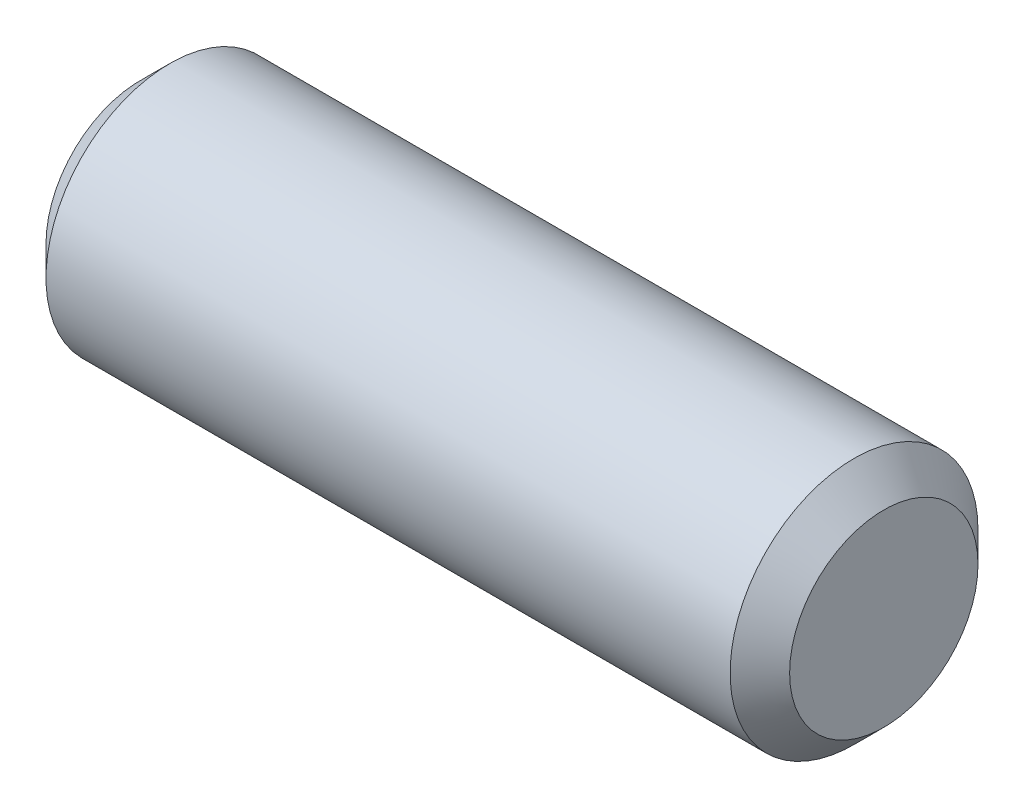
ISO-10303-21;
HEADER;
FILE_DESCRIPTION(('STEP AP214'),'2;1');
FILE_NAME('part.step','',(''),(''),'','','');
FILE_SCHEMA(('AUTOMOTIVE_DESIGN { 1 0 10303 214 1 1 1 1 }'));
ENDSEC;
DATA;
#1=APPLICATION_CONTEXT('core data for automotive mechanical design processes');
#2=APPLICATION_PROTOCOL_DEFINITION('international standard','automotive_design',2000,#1);
#3=PRODUCT_CONTEXT('',#1,'mechanical');
#4=PRODUCT('Part','Part','',(#3));
#5=PRODUCT_RELATED_PRODUCT_CATEGORY('part','',(#4));
#6=PRODUCT_DEFINITION_FORMATION('','',#4);
#7=PRODUCT_DEFINITION_CONTEXT('part definition',#1,'design');
#8=PRODUCT_DEFINITION('design','',#6,#7);
#9=PRODUCT_DEFINITION_SHAPE('','',#8);
#10=(LENGTH_UNIT() NAMED_UNIT(*) SI_UNIT(.MILLI.,.METRE.));
#11=(NAMED_UNIT(*) PLANE_ANGLE_UNIT() SI_UNIT($,.RADIAN.));
#12=(NAMED_UNIT(*) SI_UNIT($,.STERADIAN.) SOLID_ANGLE_UNIT());
#13=UNCERTAINTY_MEASURE_WITH_UNIT(LENGTH_MEASURE(1.E-05),#10,'distance_accuracy_value','');
#14=(GEOMETRIC_REPRESENTATION_CONTEXT(3) GLOBAL_UNCERTAINTY_ASSIGNED_CONTEXT((#13)) GLOBAL_UNIT_ASSIGNED_CONTEXT((#10,
#11,#12)) REPRESENTATION_CONTEXT('',''));
#15=CARTESIAN_POINT('',(0.,0.,0.));
#16=DIRECTION('',(0.,0.,1.));
#17=DIRECTION('',(1.,0.,0.));
#18=AXIS2_PLACEMENT_3D('',#15,#16,#17);
#19=CARTESIAN_POINT('',(38.1,0.,0.));
#20=DIRECTION('',(-1.,0.,0.));
#21=DIRECTION('',(0.,0.,1.));
#22=AXIS2_PLACEMENT_3D('',#19,#20,#21);
#23=CYLINDRICAL_SURFACE('',#22,6.35);
#24=CARTESIAN_POINT('',(1.52400000000003,0.,0.));
#25=DIRECTION('',(1.,0.,0.));
#26=DIRECTION('',(0.,0.,-1.));
#27=AXIS2_PLACEMENT_3D('',#24,#25,#26);
#28=CIRCLE('',#27,6.35);
#29=CARTESIAN_POINT('',(1.52400000000003,0.,-6.35));
#30=VERTEX_POINT('',#29);
#31=EDGE_CURVE('E39',#30,#30,#28,.T.);
#32=ORIENTED_EDGE('',*,*,#31,.T.);
#33=EDGE_LOOP('',(#32));
#34=FACE_BOUND('',#33,.T.);
#35=CARTESIAN_POINT('',(36.576,0.,0.));
#36=DIRECTION('',(1.,0.,0.));
#37=DIRECTION('',(0.,0.,-1.));
#38=AXIS2_PLACEMENT_3D('',#35,#36,#37);
#39=CIRCLE('',#38,6.35);
#40=CARTESIAN_POINT('',(36.576,0.,-6.35));
#41=VERTEX_POINT('',#40);
#42=EDGE_CURVE('E43',#41,#41,#39,.F.);
#43=ORIENTED_EDGE('',*,*,#42,.T.);
#44=EDGE_LOOP('',(#43));
#45=FACE_BOUND('',#44,.T.);
#46=ADVANCED_FACE('F32',(#34,#45),#23,.T.);
#47=CARTESIAN_POINT('',(38.1,0.,0.));
#48=DIRECTION('',(1.,0.,0.));
#49=DIRECTION('',(0.,0.,-1.));
#50=AXIS2_PLACEMENT_3D('',#47,#48,#49);
#51=PLANE('',#50);
#52=CARTESIAN_POINT('',(38.1,0.,0.));
#53=DIRECTION('',(1.,0.,0.));
#54=DIRECTION('',(0.,0.,-1.));
#55=AXIS2_PLACEMENT_3D('',#52,#53,#54);
#56=CIRCLE('',#55,4.82600000000004);
#57=CARTESIAN_POINT('',(38.1,0.,-4.82600000000004));
#58=VERTEX_POINT('',#57);
#59=EDGE_CURVE('E47',#58,#58,#56,.T.);
#60=ORIENTED_EDGE('',*,*,#59,.T.);
#61=EDGE_LOOP('',(#60));
#62=FACE_BOUND('',#61,.T.);
#63=ADVANCED_FACE('F53',(#62),#51,.T.);
#64=CARTESIAN_POINT('',(0.,0.,0.));
#65=DIRECTION('',(1.,0.,0.));
#66=DIRECTION('',(0.,0.,-1.));
#67=AXIS2_PLACEMENT_3D('',#64,#65,#66);
#68=PLANE('',#67);
#69=CARTESIAN_POINT('',(0.,0.,0.));
#70=DIRECTION('',(1.,0.,0.));
#71=DIRECTION('',(0.,0.,-1.));
#72=AXIS2_PLACEMENT_3D('',#69,#70,#71);
#73=CIRCLE('',#72,4.82599999999997);
#74=CARTESIAN_POINT('',(0.,0.,-4.82599999999997));
#75=VERTEX_POINT('',#74);
#76=EDGE_CURVE('E10',#75,#75,#73,.F.);
#77=ORIENTED_EDGE('',*,*,#76,.T.);
#78=EDGE_LOOP('',(#77));
#79=FACE_BOUND('',#78,.T.);
#80=ADVANCED_FACE('F57',(#79),#68,.F.);
#81=CARTESIAN_POINT('',(38.1,0.,0.));
#82=DIRECTION('',(-1.,0.,0.));
#83=DIRECTION('',(0.,0.,1.));
#84=AXIS2_PLACEMENT_3D('',#81,#82,#83);
#85=CONICAL_SURFACE('',#84,4.82600000000004,0.785398163397446);
#86=ORIENTED_EDGE('',*,*,#42,.F.);
#87=EDGE_LOOP('',(#86));
#88=FACE_BOUND('',#87,.T.);
#89=ORIENTED_EDGE('',*,*,#59,.F.);
#90=EDGE_LOOP('',(#89));
#91=FACE_BOUND('',#90,.T.);
#92=ADVANCED_FACE('F55',(#88,#91),#85,.T.);
#93=CARTESIAN_POINT('',(1.52400000000003,0.,0.));
#94=DIRECTION('',(1.,0.,0.));
#95=DIRECTION('',(0.,0.,-1.));
#96=AXIS2_PLACEMENT_3D('',#93,#94,#95);
#97=CONICAL_SURFACE('',#96,6.35,0.78539816339745);
#98=ORIENTED_EDGE('',*,*,#76,.F.);
#99=EDGE_LOOP('',(#98));
#100=FACE_BOUND('',#99,.T.);
#101=ORIENTED_EDGE('',*,*,#31,.F.);
#102=EDGE_LOOP('',(#101));
#103=FACE_BOUND('',#102,.T.);
#104=ADVANCED_FACE('F34',(#100,#103),#97,.T.);
#105=CLOSED_SHELL('',(#46,#63,#80,#92,#104));
#106=MANIFOLD_SOLID_BREP('B2',#105);
#107=ADVANCED_BREP_SHAPE_REPRESENTATION('',(#18,#106),#14);
#108=SHAPE_DEFINITION_REPRESENTATION(#9,#107);
ENDSEC;
END-ISO-10303-21;
